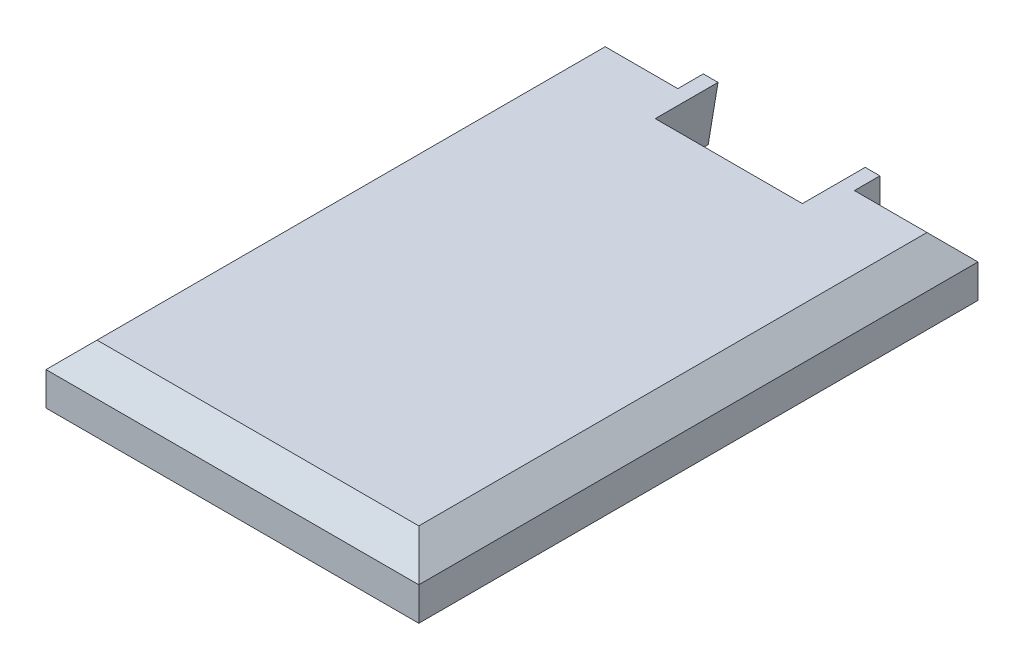
ISO-10303-21;
HEADER;
FILE_DESCRIPTION(('STEP AP214'),'2;1');
FILE_NAME('part.step','',(''),(''),'','','');
FILE_SCHEMA(('AUTOMOTIVE_DESIGN { 1 0 10303 214 1 1 1 1 }'));
ENDSEC;
DATA;
#1=APPLICATION_CONTEXT('core data for automotive mechanical design processes');
#2=APPLICATION_PROTOCOL_DEFINITION('international standard','automotive_design',2000,#1);
#3=PRODUCT_CONTEXT('',#1,'mechanical');
#4=PRODUCT('Part','Part','',(#3));
#5=PRODUCT_RELATED_PRODUCT_CATEGORY('part','',(#4));
#6=PRODUCT_DEFINITION_FORMATION('','',#4);
#7=PRODUCT_DEFINITION_CONTEXT('part definition',#1,'design');
#8=PRODUCT_DEFINITION('design','',#6,#7);
#9=PRODUCT_DEFINITION_SHAPE('','',#8);
#10=(LENGTH_UNIT() NAMED_UNIT(*) SI_UNIT(.MILLI.,.METRE.));
#11=(NAMED_UNIT(*) PLANE_ANGLE_UNIT() SI_UNIT($,.RADIAN.));
#12=(NAMED_UNIT(*) SI_UNIT($,.STERADIAN.) SOLID_ANGLE_UNIT());
#13=UNCERTAINTY_MEASURE_WITH_UNIT(LENGTH_MEASURE(1.E-05),#10,'distance_accuracy_value','');
#14=(GEOMETRIC_REPRESENTATION_CONTEXT(3) GLOBAL_UNCERTAINTY_ASSIGNED_CONTEXT((#13)) GLOBAL_UNIT_ASSIGNED_CONTEXT((#10,
#11,#12)) REPRESENTATION_CONTEXT('',''));
#15=CARTESIAN_POINT('',(0.,0.,0.));
#16=DIRECTION('',(0.,0.,1.));
#17=DIRECTION('',(1.,0.,0.));
#18=AXIS2_PLACEMENT_3D('',#15,#16,#17);
#19=CARTESIAN_POINT('',(-95.,30.,-142.5));
#20=DIRECTION('',(0.,0.,1.));
#21=DIRECTION('',(1.,0.,0.));
#22=AXIS2_PLACEMENT_3D('',#19,#20,#21);
#23=PLANE('',#22);
#24=DIRECTION('',(-1.,0.,0.));
#25=VECTOR('',#24,1.);
#26=CARTESIAN_POINT('',(95.,17.,-142.5));
#27=LINE('',#26,#25);
#28=CARTESIAN_POINT('',(95.,17.,-142.5));
#29=VERTEX_POINT('',#28);
#30=CARTESIAN_POINT('',(45.,17.,-142.5));
#31=VERTEX_POINT('',#30);
#32=EDGE_CURVE('E169',#29,#31,#27,.T.);
#33=ORIENTED_EDGE('',*,*,#32,.F.);
#34=DIRECTION('',(0.,-1.,0.));
#35=VECTOR('',#34,1.);
#36=CARTESIAN_POINT('',(95.,30.,-142.5));
#37=LINE('',#36,#35);
#38=CARTESIAN_POINT('',(95.,0.,-142.5));
#39=VERTEX_POINT('',#38);
#40=EDGE_CURVE('E232',#29,#39,#37,.T.);
#41=ORIENTED_EDGE('',*,*,#40,.T.);
#42=DIRECTION('',(-1.,0.,0.));
#43=VECTOR('',#42,1.);
#44=CARTESIAN_POINT('',(-95.,0.,-142.5));
#45=LINE('',#44,#43);
#46=CARTESIAN_POINT('',(42.5,0.,-142.5));
#47=VERTEX_POINT('',#46);
#48=EDGE_CURVE('E218',#39,#47,#45,.T.);
#49=ORIENTED_EDGE('',*,*,#48,.T.);
#50=DIRECTION('',(0.164398987305357,-0.986393923832144,0.));
#51=VECTOR('',#50,1.);
#52=CARTESIAN_POINT('',(42.5,0.,-142.5));
#53=LINE('',#52,#51);
#54=CARTESIAN_POINT('',(37.5,30.,-142.5));
#55=VERTEX_POINT('',#54);
#56=EDGE_CURVE('E178',#55,#47,#53,.T.);
#57=ORIENTED_EDGE('',*,*,#56,.F.);
#58=DIRECTION('',(-1.,0.,0.));
#59=VECTOR('',#58,1.);
#60=CARTESIAN_POINT('',(-95.,30.,-142.5));
#61=LINE('',#60,#59);
#62=CARTESIAN_POINT('',(44.9999999999999,30.,-142.5));
#63=VERTEX_POINT('',#62);
#64=EDGE_CURVE('E212',#63,#55,#61,.T.);
#65=ORIENTED_EDGE('',*,*,#64,.F.);
#66=DIRECTION('',(0.,1.,0.));
#67=VECTOR('',#66,1.);
#68=CARTESIAN_POINT('',(45.,17.,-142.5));
#69=LINE('',#68,#67);
#70=EDGE_CURVE('E167',#31,#63,#69,.T.);
#71=ORIENTED_EDGE('',*,*,#70,.F.);
#72=EDGE_LOOP('',(#33,#41,#49,#57,#65,#71));
#73=FACE_BOUND('',#72,.T.);
#74=ADVANCED_FACE('F32',(#73),#23,.F.);
#75=CARTESIAN_POINT('',(95.,30.,142.5));
#76=DIRECTION('',(-1.,0.,0.));
#77=DIRECTION('',(0.,0.,1.));
#78=AXIS2_PLACEMENT_3D('',#75,#76,#77);
#79=PLANE('',#78);
#80=ORIENTED_EDGE('',*,*,#40,.F.);
#81=DIRECTION('',(0.,0.,1.));
#82=VECTOR('',#81,1.);
#83=CARTESIAN_POINT('',(95.,17.,142.5));
#84=LINE('',#83,#82);
#85=CARTESIAN_POINT('',(95.,17.,142.5));
#86=VERTEX_POINT('',#85);
#87=EDGE_CURVE('E11',#29,#86,#84,.T.);
#88=ORIENTED_EDGE('',*,*,#87,.T.);
#89=DIRECTION('',(0.,-1.,0.));
#90=VECTOR('',#89,1.);
#91=CARTESIAN_POINT('',(95.,30.,142.5));
#92=LINE('',#91,#90);
#93=CARTESIAN_POINT('',(95.,0.,142.5));
#94=VERTEX_POINT('',#93);
#95=EDGE_CURVE('E214',#86,#94,#92,.T.);
#96=ORIENTED_EDGE('',*,*,#95,.T.);
#97=DIRECTION('',(0.,0.,-1.));
#98=VECTOR('',#97,1.);
#99=CARTESIAN_POINT('',(95.,0.,142.5));
#100=LINE('',#99,#98);
#101=EDGE_CURVE('E205',#94,#39,#100,.T.);
#102=ORIENTED_EDGE('',*,*,#101,.T.);
#103=EDGE_LOOP('',(#80,#88,#96,#102));
#104=FACE_BOUND('',#103,.T.);
#105=ADVANCED_FACE('F302',(#104),#79,.F.);
#106=CARTESIAN_POINT('',(0.,30.,0.));
#107=DIRECTION('',(0.,-1.,0.));
#108=DIRECTION('',(0.,0.,-1.));
#109=AXIS2_PLACEMENT_3D('',#106,#107,#108);
#110=PLANE('',#109);
#111=DIRECTION('',(1.,0.,0.));
#112=VECTOR('',#111,1.);
#113=CARTESIAN_POINT('',(-95.,30.,-129.5));
#114=LINE('',#113,#112);
#115=CARTESIAN_POINT('',(-82.,30.,-129.5));
#116=VERTEX_POINT('',#115);
#117=CARTESIAN_POINT('',(-45.,30.,-129.5));
#118=VERTEX_POINT('',#117);
#119=EDGE_CURVE('E127',#116,#118,#114,.T.);
#120=ORIENTED_EDGE('',*,*,#119,.F.);
#121=DIRECTION('',(0.,0.,1.));
#122=VECTOR('',#121,1.);
#123=CARTESIAN_POINT('',(-82.,30.,0.));
#124=LINE('',#123,#122);
#125=CARTESIAN_POINT('',(-82.,30.,129.5));
#126=VERTEX_POINT('',#125);
#127=EDGE_CURVE('E238',#116,#126,#124,.T.);
#128=ORIENTED_EDGE('',*,*,#127,.T.);
#129=DIRECTION('',(1.,0.,0.));
#130=VECTOR('',#129,1.);
#131=CARTESIAN_POINT('',(0.,30.,129.5));
#132=LINE('',#131,#130);
#133=CARTESIAN_POINT('',(82.,30.,129.5));
#134=VERTEX_POINT('',#133);
#135=EDGE_CURVE('E236',#126,#134,#132,.T.);
#136=ORIENTED_EDGE('',*,*,#135,.T.);
#137=DIRECTION('',(0.,0.,-1.));
#138=VECTOR('',#137,1.);
#139=CARTESIAN_POINT('',(82.,30.,0.));
#140=LINE('',#139,#138);
#141=CARTESIAN_POINT('',(82.,30.,-129.5));
#142=VERTEX_POINT('',#141);
#143=EDGE_CURVE('E234',#134,#142,#140,.T.);
#144=ORIENTED_EDGE('',*,*,#143,.T.);
#145=DIRECTION('',(-1.,0.,0.));
#146=VECTOR('',#145,1.);
#147=CARTESIAN_POINT('',(95.,30.,-129.5));
#148=LINE('',#147,#146);
#149=CARTESIAN_POINT('',(45.,30.,-129.5));
#150=VERTEX_POINT('',#149);
#151=EDGE_CURVE('E172',#142,#150,#148,.T.);
#152=ORIENTED_EDGE('',*,*,#151,.T.);
#153=DIRECTION('',(0.,0.,1.));
#154=VECTOR('',#153,1.);
#155=CARTESIAN_POINT('',(45.,30.,-142.5));
#156=LINE('',#155,#154);
#157=EDGE_CURVE('E161',#63,#150,#156,.T.);
#158=ORIENTED_EDGE('',*,*,#157,.F.);
#159=ORIENTED_EDGE('',*,*,#64,.T.);
#160=DIRECTION('',(0.,0.,-1.));
#161=VECTOR('',#160,1.);
#162=CARTESIAN_POINT('',(37.5,30.,-110.5));
#163=LINE('',#162,#161);
#164=CARTESIAN_POINT('',(37.5,30.,-110.5));
#165=VERTEX_POINT('',#164);
#166=EDGE_CURVE('E202',#165,#55,#163,.T.);
#167=ORIENTED_EDGE('',*,*,#166,.F.);
#168=DIRECTION('',(1.,0.,0.));
#169=VECTOR('',#168,1.);
#170=CARTESIAN_POINT('',(37.5,30.,-110.5));
#171=LINE('',#170,#169);
#172=CARTESIAN_POINT('',(-37.5,30.,-110.5));
#173=VERTEX_POINT('',#172);
#174=EDGE_CURVE('E196',#173,#165,#171,.T.);
#175=ORIENTED_EDGE('',*,*,#174,.F.);
#176=DIRECTION('',(0.,0.,-1.));
#177=VECTOR('',#176,1.);
#178=CARTESIAN_POINT('',(-37.5,30.,-110.5));
#179=LINE('',#178,#177);
#180=CARTESIAN_POINT('',(-37.5,30.,-142.5));
#181=VERTEX_POINT('',#180);
#182=EDGE_CURVE('E206',#173,#181,#179,.T.);
#183=ORIENTED_EDGE('',*,*,#182,.T.);
#184=CARTESIAN_POINT('',(-45.,30.,-142.5));
#185=VERTEX_POINT('',#184);
#186=EDGE_CURVE('E152',#181,#185,#61,.T.);
#187=ORIENTED_EDGE('',*,*,#186,.T.);
#188=DIRECTION('',(0.,0.,1.));
#189=VECTOR('',#188,1.);
#190=CARTESIAN_POINT('',(-45.,30.,-142.5));
#191=LINE('',#190,#189);
#192=EDGE_CURVE('E144',#185,#118,#191,.T.);
#193=ORIENTED_EDGE('',*,*,#192,.T.);
#194=EDGE_LOOP('',(#120,#128,#136,#144,#152,#158,#159,#167,#175,#183,#187,#193));
#195=FACE_BOUND('',#194,.T.);
#196=ADVANCED_FACE('F149',(#195),#110,.F.);
#197=DIRECTION('',(0.,-1.,0.));
#198=VECTOR('',#197,1.);
#199=CARTESIAN_POINT('',(-95.,30.,-142.5));
#200=LINE('',#199,#198);
#201=CARTESIAN_POINT('',(-95.,17.,-142.5));
#202=VERTEX_POINT('',#201);
#203=CARTESIAN_POINT('',(-95.,0.,-142.5));
#204=VERTEX_POINT('',#203);
#205=EDGE_CURVE('E230',#202,#204,#200,.T.);
#206=ORIENTED_EDGE('',*,*,#205,.F.);
#207=DIRECTION('',(1.,0.,0.));
#208=VECTOR('',#207,1.);
#209=CARTESIAN_POINT('',(-95.,17.,-142.5));
#210=LINE('',#209,#208);
#211=CARTESIAN_POINT('',(-45.,17.,-142.5));
#212=VERTEX_POINT('',#211);
#213=EDGE_CURVE('E139',#202,#212,#210,.T.);
#214=ORIENTED_EDGE('',*,*,#213,.T.);
#215=DIRECTION('',(0.,1.,0.));
#216=VECTOR('',#215,1.);
#217=CARTESIAN_POINT('',(-45.,17.,-142.5));
#218=LINE('',#217,#216);
#219=EDGE_CURVE('E140',#212,#185,#218,.T.);
#220=ORIENTED_EDGE('',*,*,#219,.T.);
#221=ORIENTED_EDGE('',*,*,#186,.F.);
#222=DIRECTION('',(0.164398987305357,0.986393923832144,0.));
#223=VECTOR('',#222,1.);
#224=CARTESIAN_POINT('',(-37.5,30.,-142.5));
#225=LINE('',#224,#223);
#226=CARTESIAN_POINT('',(-42.5,0.,-142.5));
#227=VERTEX_POINT('',#226);
#228=EDGE_CURVE('E190',#227,#181,#225,.T.);
#229=ORIENTED_EDGE('',*,*,#228,.F.);
#230=EDGE_CURVE('E217',#227,#204,#45,.T.);
#231=ORIENTED_EDGE('',*,*,#230,.T.);
#232=EDGE_LOOP('',(#206,#214,#220,#221,#229,#231));
#233=FACE_BOUND('',#232,.T.);
#234=ADVANCED_FACE('F315',(#233),#23,.F.);
#235=CARTESIAN_POINT('',(-95.,30.,142.5));
#236=DIRECTION('',(1.,0.,0.));
#237=DIRECTION('',(0.,0.,-1.));
#238=AXIS2_PLACEMENT_3D('',#235,#236,#237);
#239=PLANE('',#238);
#240=DIRECTION('',(0.,-1.,0.));
#241=VECTOR('',#240,1.);
#242=CARTESIAN_POINT('',(-95.,30.,142.5));
#243=LINE('',#242,#241);
#244=CARTESIAN_POINT('',(-95.,17.,142.5));
#245=VERTEX_POINT('',#244);
#246=CARTESIAN_POINT('',(-95.,0.,142.5));
#247=VERTEX_POINT('',#246);
#248=EDGE_CURVE('E228',#245,#247,#243,.T.);
#249=ORIENTED_EDGE('',*,*,#248,.F.);
#250=DIRECTION('',(0.,0.,-1.));
#251=VECTOR('',#250,1.);
#252=CARTESIAN_POINT('',(-95.,17.,142.5));
#253=LINE('',#252,#251);
#254=EDGE_CURVE('E240',#245,#202,#253,.T.);
#255=ORIENTED_EDGE('',*,*,#254,.T.);
#256=ORIENTED_EDGE('',*,*,#205,.T.);
#257=DIRECTION('',(0.,0.,1.));
#258=VECTOR('',#257,1.);
#259=CARTESIAN_POINT('',(-95.,0.,142.5));
#260=LINE('',#259,#258);
#261=EDGE_CURVE('E221',#204,#247,#260,.T.);
#262=ORIENTED_EDGE('',*,*,#261,.T.);
#263=EDGE_LOOP('',(#249,#255,#256,#262));
#264=FACE_BOUND('',#263,.T.);
#265=ADVANCED_FACE('F311',(#264),#239,.F.);
#266=CARTESIAN_POINT('',(-95.,30.,142.5));
#267=DIRECTION('',(0.,0.,-1.));
#268=DIRECTION('',(-1.,0.,0.));
#269=AXIS2_PLACEMENT_3D('',#266,#267,#268);
#270=PLANE('',#269);
#271=ORIENTED_EDGE('',*,*,#95,.F.);
#272=DIRECTION('',(-1.,0.,0.));
#273=VECTOR('',#272,1.);
#274=CARTESIAN_POINT('',(-95.,17.,142.5));
#275=LINE('',#274,#273);
#276=EDGE_CURVE('E54',#86,#245,#275,.T.);
#277=ORIENTED_EDGE('',*,*,#276,.T.);
#278=ORIENTED_EDGE('',*,*,#248,.T.);
#279=DIRECTION('',(1.,0.,0.));
#280=VECTOR('',#279,1.);
#281=CARTESIAN_POINT('',(-95.,0.,142.5));
#282=LINE('',#281,#280);
#283=EDGE_CURVE('E224',#247,#94,#282,.T.);
#284=ORIENTED_EDGE('',*,*,#283,.T.);
#285=EDGE_LOOP('',(#271,#277,#278,#284));
#286=FACE_BOUND('',#285,.T.);
#287=ADVANCED_FACE('F286',(#286),#270,.F.);
#288=CARTESIAN_POINT('',(0.,0.,0.));
#289=DIRECTION('',(0.,-1.,0.));
#290=DIRECTION('',(0.,0.,-1.));
#291=AXIS2_PLACEMENT_3D('',#288,#289,#290);
#292=PLANE('',#291);
#293=CARTESIAN_POINT('',(75.,0.,122.5));
#294=DIRECTION('',(0.,-1.,0.));
#295=DIRECTION('',(0.,0.,-1.));
#296=AXIS2_PLACEMENT_3D('',#293,#294,#295);
#297=CIRCLE('',#296,1.5);
#298=CARTESIAN_POINT('',(75.,0.,121.));
#299=VERTEX_POINT('',#298);
#300=EDGE_CURVE('E262',#299,#299,#297,.T.);
#301=ORIENTED_EDGE('',*,*,#300,.F.);
#302=EDGE_LOOP('',(#301));
#303=FACE_BOUND('',#302,.T.);
#304=CARTESIAN_POINT('',(-75.,0.,-122.5));
#305=DIRECTION('',(0.,-1.,0.));
#306=DIRECTION('',(0.,0.,-1.));
#307=AXIS2_PLACEMENT_3D('',#304,#305,#306);
#308=CIRCLE('',#307,1.5);
#309=CARTESIAN_POINT('',(-75.,0.,-124.));
#310=VERTEX_POINT('',#309);
#311=EDGE_CURVE('E255',#310,#310,#308,.T.);
#312=ORIENTED_EDGE('',*,*,#311,.F.);
#313=EDGE_LOOP('',(#312));
#314=FACE_BOUND('',#313,.T.);
#315=CARTESIAN_POINT('',(75.,0.,-122.5));
#316=DIRECTION('',(0.,-1.,0.));
#317=DIRECTION('',(0.,0.,-1.));
#318=AXIS2_PLACEMENT_3D('',#315,#316,#317);
#319=CIRCLE('',#318,1.5);
#320=CARTESIAN_POINT('',(75.,0.,-124.));
#321=VERTEX_POINT('',#320);
#322=EDGE_CURVE('E267',#321,#321,#319,.T.);
#323=ORIENTED_EDGE('',*,*,#322,.F.);
#324=EDGE_LOOP('',(#323));
#325=FACE_BOUND('',#324,.T.);
#326=CARTESIAN_POINT('',(-75.,0.,122.5));
#327=DIRECTION('',(0.,-1.,0.));
#328=DIRECTION('',(0.,0.,-1.));
#329=AXIS2_PLACEMENT_3D('',#326,#327,#328);
#330=CIRCLE('',#329,1.5);
#331=CARTESIAN_POINT('',(-75.,0.,121.));
#332=VERTEX_POINT('',#331);
#333=EDGE_CURVE('E157',#332,#332,#330,.T.);
#334=ORIENTED_EDGE('',*,*,#333,.F.);
#335=EDGE_LOOP('',(#334));
#336=FACE_BOUND('',#335,.T.);
#337=DIRECTION('',(0.,0.,-1.));
#338=VECTOR('',#337,1.);
#339=CARTESIAN_POINT('',(42.5,0.,-110.5));
#340=LINE('',#339,#338);
#341=CARTESIAN_POINT('',(42.5,0.,-110.5));
#342=VERTEX_POINT('',#341);
#343=EDGE_CURVE('E199',#342,#47,#340,.T.);
#344=ORIENTED_EDGE('',*,*,#343,.T.);
#345=ORIENTED_EDGE('',*,*,#48,.F.);
#346=ORIENTED_EDGE('',*,*,#101,.F.);
#347=ORIENTED_EDGE('',*,*,#283,.F.);
#348=ORIENTED_EDGE('',*,*,#261,.F.);
#349=ORIENTED_EDGE('',*,*,#230,.F.);
#350=DIRECTION('',(0.,0.,-1.));
#351=VECTOR('',#350,1.);
#352=CARTESIAN_POINT('',(-42.5,0.,-110.5));
#353=LINE('',#352,#351);
#354=CARTESIAN_POINT('',(-42.5,0.,-110.5));
#355=VERTEX_POINT('',#354);
#356=EDGE_CURVE('E208',#355,#227,#353,.T.);
#357=ORIENTED_EDGE('',*,*,#356,.F.);
#358=DIRECTION('',(-1.,0.,0.));
#359=VECTOR('',#358,1.);
#360=CARTESIAN_POINT('',(-42.5,0.,-110.5));
#361=LINE('',#360,#359);
#362=EDGE_CURVE('E189',#342,#355,#361,.T.);
#363=ORIENTED_EDGE('',*,*,#362,.F.);
#364=EDGE_LOOP('',(#344,#345,#346,#347,#348,#349,#357,#363));
#365=FACE_BOUND('',#364,.T.);
#366=ADVANCED_FACE('F282',(#303,#314,#325,#336,#365),#292,.T.);
#367=CARTESIAN_POINT('',(42.5,0.,-110.5));
#368=DIRECTION('',(0.986393923832144,0.164398987305357,0.));
#369=DIRECTION('',(-0.164398987305357,0.986393923832144,0.));
#370=AXIS2_PLACEMENT_3D('',#367,#368,#369);
#371=PLANE('',#370);
#372=ORIENTED_EDGE('',*,*,#56,.T.);
#373=ORIENTED_EDGE('',*,*,#343,.F.);
#374=DIRECTION('',(0.164398987305357,-0.986393923832144,0.));
#375=VECTOR('',#374,1.);
#376=CARTESIAN_POINT('',(42.5,0.,-110.5));
#377=LINE('',#376,#375);
#378=EDGE_CURVE('E187',#165,#342,#377,.T.);
#379=ORIENTED_EDGE('',*,*,#378,.F.);
#380=ORIENTED_EDGE('',*,*,#166,.T.);
#381=EDGE_LOOP('',(#372,#373,#379,#380));
#382=FACE_BOUND('',#381,.T.);
#383=ADVANCED_FACE('F285',(#382),#371,.F.);
#384=CARTESIAN_POINT('',(-37.5,30.,-110.5));
#385=DIRECTION('',(-0.986393923832144,0.164398987305357,0.));
#386=DIRECTION('',(-0.164398987305357,-0.986393923832144,0.));
#387=AXIS2_PLACEMENT_3D('',#384,#385,#386);
#388=PLANE('',#387);
#389=ORIENTED_EDGE('',*,*,#228,.T.);
#390=ORIENTED_EDGE('',*,*,#182,.F.);
#391=DIRECTION('',(0.164398987305357,0.986393923832144,0.));
#392=VECTOR('',#391,1.);
#393=CARTESIAN_POINT('',(-37.5,30.,-110.5));
#394=LINE('',#393,#392);
#395=EDGE_CURVE('E193',#355,#173,#394,.T.);
#396=ORIENTED_EDGE('',*,*,#395,.F.);
#397=ORIENTED_EDGE('',*,*,#356,.T.);
#398=EDGE_LOOP('',(#389,#390,#396,#397));
#399=FACE_BOUND('',#398,.T.);
#400=ADVANCED_FACE('F342',(#399),#388,.F.);
#401=CARTESIAN_POINT('',(0.,0.,-110.5));
#402=DIRECTION('',(0.,0.,1.));
#403=DIRECTION('',(1.,0.,0.));
#404=AXIS2_PLACEMENT_3D('',#401,#402,#403);
#405=PLANE('',#404);
#406=CARTESIAN_POINT('',(25.,14.,-110.5));
#407=DIRECTION('',(0.,0.,-1.));
#408=DIRECTION('',(-1.,0.,0.));
#409=AXIS2_PLACEMENT_3D('',#406,#407,#408);
#410=CIRCLE('',#409,1.5);
#411=CARTESIAN_POINT('',(23.5,14.,-110.5));
#412=VERTEX_POINT('',#411);
#413=EDGE_CURVE('E179',#412,#412,#410,.T.);
#414=ORIENTED_EDGE('',*,*,#413,.F.);
#415=EDGE_LOOP('',(#414));
#416=FACE_BOUND('',#415,.T.);
#417=CARTESIAN_POINT('',(-24.9999999999999,14.,-110.5));
#418=DIRECTION('',(0.,0.,-1.));
#419=DIRECTION('',(1.,0.,0.));
#420=AXIS2_PLACEMENT_3D('',#417,#418,#419);
#421=CIRCLE('',#420,1.5);
#422=CARTESIAN_POINT('',(-23.4999999999999,14.,-110.5));
#423=VERTEX_POINT('',#422);
#424=EDGE_CURVE('E174',#423,#423,#421,.T.);
#425=ORIENTED_EDGE('',*,*,#424,.F.);
#426=EDGE_LOOP('',(#425));
#427=FACE_BOUND('',#426,.T.);
#428=ORIENTED_EDGE('',*,*,#378,.T.);
#429=ORIENTED_EDGE('',*,*,#362,.T.);
#430=ORIENTED_EDGE('',*,*,#395,.T.);
#431=ORIENTED_EDGE('',*,*,#174,.T.);
#432=EDGE_LOOP('',(#428,#429,#430,#431));
#433=FACE_BOUND('',#432,.T.);
#434=ADVANCED_FACE('F345',(#416,#427,#433),#405,.F.);
#435=CARTESIAN_POINT('',(-24.9999999999999,14.,-70.5));
#436=DIRECTION('',(0.,0.,-1.));
#437=DIRECTION('',(-1.,0.,0.));
#438=AXIS2_PLACEMENT_3D('',#435,#436,#437);
#439=CYLINDRICAL_SURFACE('',#438,1.5);
#440=CARTESIAN_POINT('',(-24.9999999999999,14.,-70.5));
#441=DIRECTION('',(0.,0.,-1.));
#442=DIRECTION('',(1.,0.,0.));
#443=AXIS2_PLACEMENT_3D('',#440,#441,#442);
#444=CIRCLE('',#443,1.5);
#445=CARTESIAN_POINT('',(-23.4999999999999,14.,-70.5));
#446=VERTEX_POINT('',#445);
#447=EDGE_CURVE('E182',#446,#446,#444,.T.);
#448=ORIENTED_EDGE('',*,*,#447,.F.);
#449=EDGE_LOOP('',(#448));
#450=FACE_BOUND('',#449,.T.);
#451=ORIENTED_EDGE('',*,*,#424,.T.);
#452=EDGE_LOOP('',(#451));
#453=FACE_BOUND('',#452,.T.);
#454=ADVANCED_FACE('F349',(#450,#453),#439,.F.);
#455=CARTESIAN_POINT('',(-24.9999999999999,14.,-70.5));
#456=DIRECTION('',(0.,0.,1.));
#457=DIRECTION('',(1.,0.,0.));
#458=AXIS2_PLACEMENT_3D('',#455,#456,#457);
#459=PLANE('',#458);
#460=ORIENTED_EDGE('',*,*,#447,.T.);
#461=EDGE_LOOP('',(#460));
#462=FACE_BOUND('',#461,.T.);
#463=ADVANCED_FACE('F353',(#462),#459,.F.);
#464=CARTESIAN_POINT('',(25.,14.,-70.5));
#465=DIRECTION('',(0.,0.,-1.));
#466=DIRECTION('',(-1.,0.,0.));
#467=AXIS2_PLACEMENT_3D('',#464,#465,#466);
#468=CYLINDRICAL_SURFACE('',#467,1.5);
#469=CARTESIAN_POINT('',(25.,14.,-70.5));
#470=DIRECTION('',(0.,0.,-1.));
#471=DIRECTION('',(-1.,0.,0.));
#472=AXIS2_PLACEMENT_3D('',#469,#470,#471);
#473=CIRCLE('',#472,1.5);
#474=CARTESIAN_POINT('',(23.5,14.,-70.5));
#475=VERTEX_POINT('',#474);
#476=EDGE_CURVE('E175',#475,#475,#473,.T.);
#477=ORIENTED_EDGE('',*,*,#476,.F.);
#478=EDGE_LOOP('',(#477));
#479=FACE_BOUND('',#478,.T.);
#480=ORIENTED_EDGE('',*,*,#413,.T.);
#481=EDGE_LOOP('',(#480));
#482=FACE_BOUND('',#481,.T.);
#483=ADVANCED_FACE('F357',(#479,#482),#468,.F.);
#484=CARTESIAN_POINT('',(25.,14.,-70.5));
#485=DIRECTION('',(0.,0.,-1.));
#486=DIRECTION('',(-1.,0.,0.));
#487=AXIS2_PLACEMENT_3D('',#484,#485,#486);
#488=PLANE('',#487);
#489=ORIENTED_EDGE('',*,*,#476,.T.);
#490=EDGE_LOOP('',(#489));
#491=FACE_BOUND('',#490,.T.);
#492=ADVANCED_FACE('F361',(#491),#488,.T.);
#493=CARTESIAN_POINT('',(95.,30.,-129.5));
#494=DIRECTION('',(0.,0.707106781186551,-0.707106781186544));
#495=DIRECTION('',(0.,0.707106781186544,0.707106781186551));
#496=AXIS2_PLACEMENT_3D('',#493,#494,#495);
#497=PLANE('',#496);
#498=ORIENTED_EDGE('',*,*,#151,.F.);
#499=DIRECTION('',(-0.577350269189623,0.577350269189624,0.57735026918963));
#500=VECTOR('',#499,1.);
#501=CARTESIAN_POINT('',(86.3333333333333,25.6666666666667,-133.833333333333));
#502=LINE('',#501,#500);
#503=EDGE_CURVE('E41',#142,#29,#502,.F.);
#504=ORIENTED_EDGE('',*,*,#503,.T.);
#505=ORIENTED_EDGE('',*,*,#32,.T.);
#506=DIRECTION('',(0.,-0.707106781186544,-0.707106781186551));
#507=VECTOR('',#506,1.);
#508=CARTESIAN_POINT('',(45.,30.,-129.5));
#509=LINE('',#508,#507);
#510=EDGE_CURVE('E165',#150,#31,#509,.T.);
#511=ORIENTED_EDGE('',*,*,#510,.F.);
#512=EDGE_LOOP('',(#498,#504,#505,#511));
#513=FACE_BOUND('',#512,.T.);
#514=ADVANCED_FACE('F365',(#513),#497,.T.);
#515=CARTESIAN_POINT('',(45.,0.,0.));
#516=DIRECTION('',(-1.,0.,0.));
#517=DIRECTION('',(0.,0.,1.));
#518=AXIS2_PLACEMENT_3D('',#515,#516,#517);
#519=PLANE('',#518);
#520=ORIENTED_EDGE('',*,*,#157,.T.);
#521=ORIENTED_EDGE('',*,*,#510,.T.);
#522=ORIENTED_EDGE('',*,*,#70,.T.);
#523=EDGE_LOOP('',(#520,#521,#522));
#524=FACE_BOUND('',#523,.T.);
#525=ADVANCED_FACE('F369',(#524),#519,.F.);
#526=CARTESIAN_POINT('',(-95.,30.,-129.5));
#527=DIRECTION('',(0.,-0.707106781186551,0.707106781186544));
#528=DIRECTION('',(0.,-0.707106781186544,-0.707106781186551));
#529=AXIS2_PLACEMENT_3D('',#526,#527,#528);
#530=PLANE('',#529);
#531=ORIENTED_EDGE('',*,*,#213,.F.);
#532=DIRECTION('',(-0.577350269189623,-0.577350269189624,-0.57735026918963));
#533=VECTOR('',#532,1.);
#534=CARTESIAN_POINT('',(-38.8333333333333,73.1666666666668,-86.3333333333326));
#535=LINE('',#534,#533);
#536=EDGE_CURVE('E134',#202,#116,#535,.F.);
#537=ORIENTED_EDGE('',*,*,#536,.T.);
#538=ORIENTED_EDGE('',*,*,#119,.T.);
#539=DIRECTION('',(0.,-0.707106781186544,-0.707106781186551));
#540=VECTOR('',#539,1.);
#541=CARTESIAN_POINT('',(-45.,30.,-129.5));
#542=LINE('',#541,#540);
#543=EDGE_CURVE('E131',#118,#212,#542,.T.);
#544=ORIENTED_EDGE('',*,*,#543,.T.);
#545=EDGE_LOOP('',(#531,#537,#538,#544));
#546=FACE_BOUND('',#545,.T.);
#547=ADVANCED_FACE('F130',(#546),#530,.F.);
#548=CARTESIAN_POINT('',(-45.,0.,0.));
#549=DIRECTION('',(-1.,0.,0.));
#550=DIRECTION('',(0.,0.,1.));
#551=AXIS2_PLACEMENT_3D('',#548,#549,#550);
#552=PLANE('',#551);
#553=ORIENTED_EDGE('',*,*,#192,.F.);
#554=ORIENTED_EDGE('',*,*,#219,.F.);
#555=ORIENTED_EDGE('',*,*,#543,.F.);
#556=EDGE_LOOP('',(#553,#554,#555));
#557=FACE_BOUND('',#556,.T.);
#558=ADVANCED_FACE('F143',(#557),#552,.T.);
#559=CARTESIAN_POINT('',(82.,30.,0.));
#560=DIRECTION('',(-0.707106781186548,-0.707106781186547,0.));
#561=DIRECTION('',(0.,0.,-1.));
#562=AXIS2_PLACEMENT_3D('',#559,#560,#561);
#563=PLANE('',#562);
#564=ORIENTED_EDGE('',*,*,#503,.F.);
#565=ORIENTED_EDGE('',*,*,#143,.F.);
#566=DIRECTION('',(0.577350269189625,-0.577350269189627,0.577350269189625));
#567=VECTOR('',#566,1.);
#568=CARTESIAN_POINT('',(38.8333333333334,73.1666666666667,86.3333333333334));
#569=LINE('',#568,#567);
#570=EDGE_CURVE('E36',#86,#134,#569,.F.);
#571=ORIENTED_EDGE('',*,*,#570,.F.);
#572=ORIENTED_EDGE('',*,*,#87,.F.);
#573=EDGE_LOOP('',(#564,#565,#571,#572));
#574=FACE_BOUND('',#573,.T.);
#575=ADVANCED_FACE('F34',(#574),#563,.F.);
#576=CARTESIAN_POINT('',(0.,30.,129.5));
#577=DIRECTION('',(0.,-0.707106781186547,-0.707106781186548));
#578=DIRECTION('',(1.,0.,0.));
#579=AXIS2_PLACEMENT_3D('',#576,#577,#578);
#580=PLANE('',#579);
#581=ORIENTED_EDGE('',*,*,#570,.T.);
#582=ORIENTED_EDGE('',*,*,#135,.F.);
#583=DIRECTION('',(-0.577350269189625,-0.577350269189627,0.577350269189625));
#584=VECTOR('',#583,1.);
#585=CARTESIAN_POINT('',(-54.6666666666667,57.3333333333333,102.166666666667));
#586=LINE('',#585,#584);
#587=EDGE_CURVE('E155',#245,#126,#586,.F.);
#588=ORIENTED_EDGE('',*,*,#587,.F.);
#589=ORIENTED_EDGE('',*,*,#276,.F.);
#590=EDGE_LOOP('',(#581,#582,#588,#589));
#591=FACE_BOUND('',#590,.T.);
#592=ADVANCED_FACE('F308',(#591),#580,.F.);
#593=CARTESIAN_POINT('',(-82.,30.,0.));
#594=DIRECTION('',(0.707106781186548,-0.707106781186547,0.));
#595=DIRECTION('',(0.,0.,1.));
#596=AXIS2_PLACEMENT_3D('',#593,#594,#595);
#597=PLANE('',#596);
#598=ORIENTED_EDGE('',*,*,#536,.F.);
#599=ORIENTED_EDGE('',*,*,#254,.F.);
#600=ORIENTED_EDGE('',*,*,#587,.T.);
#601=ORIENTED_EDGE('',*,*,#127,.F.);
#602=EDGE_LOOP('',(#598,#599,#600,#601));
#603=FACE_BOUND('',#602,.T.);
#604=ADVANCED_FACE('F309',(#603),#597,.F.);
#605=CARTESIAN_POINT('',(-75.,5.,122.5));
#606=DIRECTION('',(0.,-1.,0.));
#607=DIRECTION('',(0.,0.,-1.));
#608=AXIS2_PLACEMENT_3D('',#605,#606,#607);
#609=CYLINDRICAL_SURFACE('',#608,1.5);
#610=CARTESIAN_POINT('',(-75.,5.,122.5));
#611=DIRECTION('',(0.,-1.,0.));
#612=DIRECTION('',(0.,0.,-1.));
#613=AXIS2_PLACEMENT_3D('',#610,#611,#612);
#614=CIRCLE('',#613,1.5);
#615=CARTESIAN_POINT('',(-75.,5.,121.));
#616=VERTEX_POINT('',#615);
#617=EDGE_CURVE('E244',#616,#616,#614,.T.);
#618=ORIENTED_EDGE('',*,*,#617,.F.);
#619=EDGE_LOOP('',(#618));
#620=FACE_BOUND('',#619,.T.);
#621=ORIENTED_EDGE('',*,*,#333,.T.);
#622=EDGE_LOOP('',(#621));
#623=FACE_BOUND('',#622,.T.);
#624=ADVANCED_FACE('F378',(#620,#623),#609,.F.);
#625=CARTESIAN_POINT('',(-75.,5.,122.5));
#626=DIRECTION('',(0.,-1.,0.));
#627=DIRECTION('',(0.,0.,-1.));
#628=AXIS2_PLACEMENT_3D('',#625,#626,#627);
#629=PLANE('',#628);
#630=ORIENTED_EDGE('',*,*,#617,.T.);
#631=EDGE_LOOP('',(#630));
#632=FACE_BOUND('',#631,.T.);
#633=ADVANCED_FACE('F278',(#632),#629,.T.);
#634=CARTESIAN_POINT('',(75.,5.,-122.5));
#635=DIRECTION('',(0.,-1.,0.));
#636=DIRECTION('',(0.,0.,-1.));
#637=AXIS2_PLACEMENT_3D('',#634,#635,#636);
#638=CYLINDRICAL_SURFACE('',#637,1.5);
#639=CARTESIAN_POINT('',(75.,5.,-122.5));
#640=DIRECTION('',(0.,-1.,0.));
#641=DIRECTION('',(0.,0.,-1.));
#642=AXIS2_PLACEMENT_3D('',#639,#640,#641);
#643=CIRCLE('',#642,1.5);
#644=CARTESIAN_POINT('',(75.,5.,-124.));
#645=VERTEX_POINT('',#644);
#646=EDGE_CURVE('E259',#645,#645,#643,.T.);
#647=ORIENTED_EDGE('',*,*,#646,.F.);
#648=EDGE_LOOP('',(#647));
#649=FACE_BOUND('',#648,.T.);
#650=ORIENTED_EDGE('',*,*,#322,.T.);
#651=EDGE_LOOP('',(#650));
#652=FACE_BOUND('',#651,.T.);
#653=ADVANCED_FACE('F275',(#649,#652),#638,.F.);
#654=CARTESIAN_POINT('',(75.,5.,-122.5));
#655=DIRECTION('',(0.,-1.,0.));
#656=DIRECTION('',(0.,0.,-1.));
#657=AXIS2_PLACEMENT_3D('',#654,#655,#656);
#658=PLANE('',#657);
#659=ORIENTED_EDGE('',*,*,#646,.T.);
#660=EDGE_LOOP('',(#659));
#661=FACE_BOUND('',#660,.T.);
#662=ADVANCED_FACE('F273',(#661),#658,.T.);
#663=CARTESIAN_POINT('',(-75.,5.,-122.5));
#664=DIRECTION('',(0.,-1.,0.));
#665=DIRECTION('',(0.,0.,-1.));
#666=AXIS2_PLACEMENT_3D('',#663,#664,#665);
#667=CYLINDRICAL_SURFACE('',#666,1.5);
#668=CARTESIAN_POINT('',(-75.,5.,-122.5));
#669=DIRECTION('',(0.,-1.,0.));
#670=DIRECTION('',(0.,0.,-1.));
#671=AXIS2_PLACEMENT_3D('',#668,#669,#670);
#672=CIRCLE('',#671,1.5);
#673=CARTESIAN_POINT('',(-75.,5.,-124.));
#674=VERTEX_POINT('',#673);
#675=EDGE_CURVE('E258',#674,#674,#672,.T.);
#676=ORIENTED_EDGE('',*,*,#675,.F.);
#677=EDGE_LOOP('',(#676));
#678=FACE_BOUND('',#677,.T.);
#679=ORIENTED_EDGE('',*,*,#311,.T.);
#680=EDGE_LOOP('',(#679));
#681=FACE_BOUND('',#680,.T.);
#682=ADVANCED_FACE('F384',(#678,#681),#667,.F.);
#683=CARTESIAN_POINT('',(-75.,5.,-122.5));
#684=DIRECTION('',(0.,-1.,0.));
#685=DIRECTION('',(0.,0.,-1.));
#686=AXIS2_PLACEMENT_3D('',#683,#684,#685);
#687=PLANE('',#686);
#688=ORIENTED_EDGE('',*,*,#675,.T.);
#689=EDGE_LOOP('',(#688));
#690=FACE_BOUND('',#689,.T.);
#691=ADVANCED_FACE('F387',(#690),#687,.T.);
#692=CARTESIAN_POINT('',(75.,5.,122.5));
#693=DIRECTION('',(0.,-1.,0.));
#694=DIRECTION('',(0.,0.,-1.));
#695=AXIS2_PLACEMENT_3D('',#692,#693,#694);
#696=CYLINDRICAL_SURFACE('',#695,1.5);
#697=CARTESIAN_POINT('',(75.,5.,122.5));
#698=DIRECTION('',(0.,-1.,0.));
#699=DIRECTION('',(0.,0.,-1.));
#700=AXIS2_PLACEMENT_3D('',#697,#698,#699);
#701=CIRCLE('',#700,1.5);
#702=CARTESIAN_POINT('',(75.,5.,121.));
#703=VERTEX_POINT('',#702);
#704=EDGE_CURVE('E253',#703,#703,#701,.T.);
#705=ORIENTED_EDGE('',*,*,#704,.F.);
#706=EDGE_LOOP('',(#705));
#707=FACE_BOUND('',#706,.T.);
#708=ORIENTED_EDGE('',*,*,#300,.T.);
#709=EDGE_LOOP('',(#708));
#710=FACE_BOUND('',#709,.T.);
#711=ADVANCED_FACE('F391',(#707,#710),#696,.F.);
#712=CARTESIAN_POINT('',(75.,5.,122.5));
#713=DIRECTION('',(0.,-1.,0.));
#714=DIRECTION('',(0.,0.,-1.));
#715=AXIS2_PLACEMENT_3D('',#712,#713,#714);
#716=PLANE('',#715);
#717=ORIENTED_EDGE('',*,*,#704,.T.);
#718=EDGE_LOOP('',(#717));
#719=FACE_BOUND('',#718,.T.);
#720=ADVANCED_FACE('F395',(#719),#716,.T.);
#721=CLOSED_SHELL('',(#74,#105,#196,#234,#265,#287,#366,#383,#400,#434,#454,#463,#483,#492,#514,
#525,#547,#558,#575,#592,#604,#624,#633,#653,#662,#682,#691,#711,#720));
#722=MANIFOLD_SOLID_BREP('B2',#721);
#723=ADVANCED_BREP_SHAPE_REPRESENTATION('',(#18,#722),#14);
#724=SHAPE_DEFINITION_REPRESENTATION(#9,#723);
ENDSEC;
END-ISO-10303-21;
